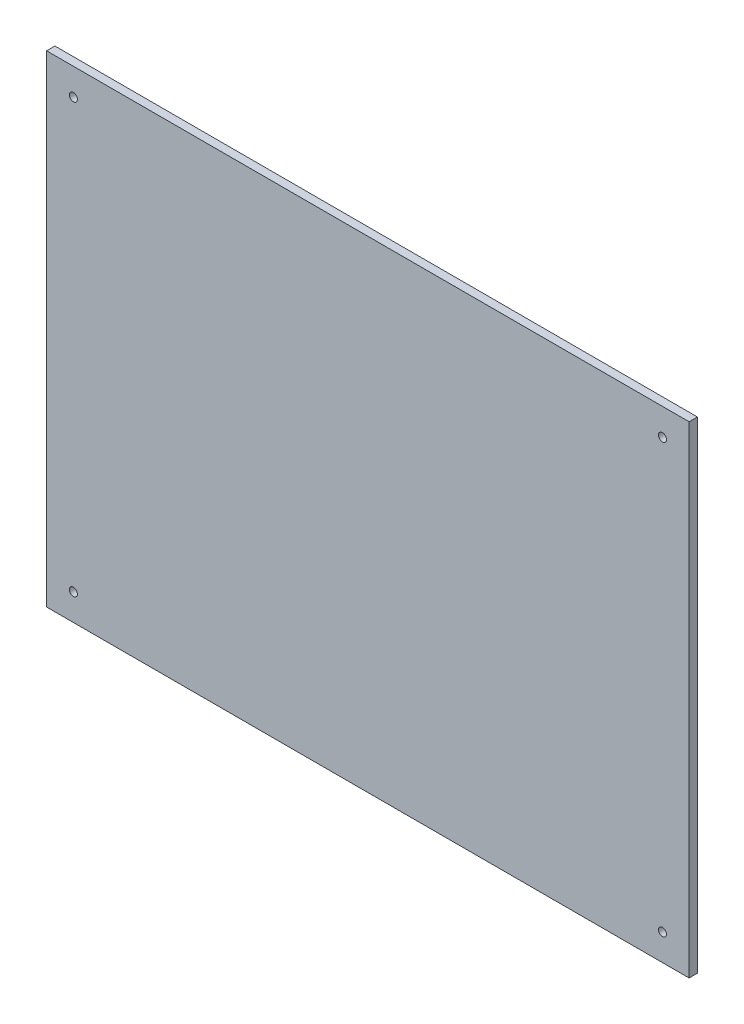
ISO-10303-21;
HEADER;
FILE_DESCRIPTION(('STEP AP214'),'2;1');
FILE_NAME('part.step','',(''),(''),'','','');
FILE_SCHEMA(('AUTOMOTIVE_DESIGN { 1 0 10303 214 1 1 1 1 }'));
ENDSEC;
DATA;
#1=APPLICATION_CONTEXT('core data for automotive mechanical design processes');
#2=APPLICATION_PROTOCOL_DEFINITION('international standard','automotive_design',2000,#1);
#3=PRODUCT_CONTEXT('',#1,'mechanical');
#4=PRODUCT('Part','Part','',(#3));
#5=PRODUCT_RELATED_PRODUCT_CATEGORY('part','',(#4));
#6=PRODUCT_DEFINITION_FORMATION('','',#4);
#7=PRODUCT_DEFINITION_CONTEXT('part definition',#1,'design');
#8=PRODUCT_DEFINITION('design','',#6,#7);
#9=PRODUCT_DEFINITION_SHAPE('','',#8);
#10=(LENGTH_UNIT() NAMED_UNIT(*) SI_UNIT(.MILLI.,.METRE.));
#11=(NAMED_UNIT(*) PLANE_ANGLE_UNIT() SI_UNIT($,.RADIAN.));
#12=(NAMED_UNIT(*) SI_UNIT($,.STERADIAN.) SOLID_ANGLE_UNIT());
#13=UNCERTAINTY_MEASURE_WITH_UNIT(LENGTH_MEASURE(1.E-05),#10,'distance_accuracy_value','');
#14=(GEOMETRIC_REPRESENTATION_CONTEXT(3) GLOBAL_UNCERTAINTY_ASSIGNED_CONTEXT((#13)) GLOBAL_UNIT_ASSIGNED_CONTEXT((#10,
#11,#12)) REPRESENTATION_CONTEXT('',''));
#15=CARTESIAN_POINT('',(0.,0.,0.));
#16=DIRECTION('',(0.,0.,1.));
#17=DIRECTION('',(1.,0.,0.));
#18=AXIS2_PLACEMENT_3D('',#15,#16,#17);
#19=CARTESIAN_POINT('',(0.,0.,1.5748));
#20=DIRECTION('',(0.,0.,1.));
#21=DIRECTION('',(1.,0.,0.));
#22=AXIS2_PLACEMENT_3D('',#19,#20,#21);
#23=PLANE('',#22);
#24=CARTESIAN_POINT('',(55.8900000000009,-40.66,1.5748));
#25=DIRECTION('',(0.,0.,1.));
#26=DIRECTION('',(1.,0.,0.));
#27=AXIS2_PLACEMENT_3D('',#24,#25,#26);
#28=CIRCLE('',#27,0.761999999999996);
#29=CARTESIAN_POINT('',(56.6520000000009,-40.66,1.5748));
#30=VERTEX_POINT('',#29);
#31=EDGE_CURVE('E121',#30,#30,#28,.T.);
#32=ORIENTED_EDGE('',*,*,#31,.F.);
#33=EDGE_LOOP('',(#32));
#34=FACE_BOUND('',#33,.T.);
#35=CARTESIAN_POINT('',(-55.87,40.62,1.5748));
#36=DIRECTION('',(0.,0.,1.));
#37=DIRECTION('',(1.,0.,0.));
#38=AXIS2_PLACEMENT_3D('',#35,#36,#37);
#39=CIRCLE('',#38,0.761999999999996);
#40=CARTESIAN_POINT('',(-55.108,40.62,1.5748));
#41=VERTEX_POINT('',#40);
#42=EDGE_CURVE('E100',#41,#41,#39,.T.);
#43=ORIENTED_EDGE('',*,*,#42,.F.);
#44=EDGE_LOOP('',(#43));
#45=FACE_BOUND('',#44,.T.);
#46=DIRECTION('',(0.,-1.,0.));
#47=VECTOR('',#46,1.);
#48=CARTESIAN_POINT('',(-60.95,-45.7,1.5748));
#49=LINE('',#48,#47);
#50=CARTESIAN_POINT('',(-60.95,45.7,1.5748));
#51=VERTEX_POINT('',#50);
#52=CARTESIAN_POINT('',(-60.95,-45.7,1.5748));
#53=VERTEX_POINT('',#52);
#54=EDGE_CURVE('E85',#51,#53,#49,.T.);
#55=ORIENTED_EDGE('',*,*,#54,.T.);
#56=DIRECTION('',(1.,0.,0.));
#57=VECTOR('',#56,1.);
#58=CARTESIAN_POINT('',(60.95,-45.7,1.5748));
#59=LINE('',#58,#57);
#60=CARTESIAN_POINT('',(60.95,-45.7,1.5748));
#61=VERTEX_POINT('',#60);
#62=EDGE_CURVE('E80',#53,#61,#59,.T.);
#63=ORIENTED_EDGE('',*,*,#62,.T.);
#64=DIRECTION('',(0.,1.,0.));
#65=VECTOR('',#64,1.);
#66=CARTESIAN_POINT('',(60.95,-45.7,1.5748));
#67=LINE('',#66,#65);
#68=CARTESIAN_POINT('',(60.95,45.7,1.5748));
#69=VERTEX_POINT('',#68);
#70=EDGE_CURVE('E83',#61,#69,#67,.T.);
#71=ORIENTED_EDGE('',*,*,#70,.T.);
#72=DIRECTION('',(-1.,0.,0.));
#73=VECTOR('',#72,1.);
#74=CARTESIAN_POINT('',(60.95,45.7,1.5748));
#75=LINE('',#74,#73);
#76=EDGE_CURVE('E50',#69,#51,#75,.T.);
#77=ORIENTED_EDGE('',*,*,#76,.T.);
#78=EDGE_LOOP('',(#55,#63,#71,#77));
#79=FACE_BOUND('',#78,.T.);
#80=CARTESIAN_POINT('',(55.89,40.62,1.5748));
#81=DIRECTION('',(0.,0.,1.));
#82=DIRECTION('',(1.,0.,0.));
#83=AXIS2_PLACEMENT_3D('',#80,#81,#82);
#84=CIRCLE('',#83,0.761999999999996);
#85=CARTESIAN_POINT('',(56.652,40.62,1.5748));
#86=VERTEX_POINT('',#85);
#87=EDGE_CURVE('E115',#86,#86,#84,.T.);
#88=ORIENTED_EDGE('',*,*,#87,.F.);
#89=EDGE_LOOP('',(#88));
#90=FACE_BOUND('',#89,.T.);
#91=CARTESIAN_POINT('',(-55.8699999999991,-40.66,1.5748));
#92=DIRECTION('',(0.,0.,1.));
#93=DIRECTION('',(1.,0.,0.));
#94=AXIS2_PLACEMENT_3D('',#91,#92,#93);
#95=CIRCLE('',#94,0.761999999999996);
#96=CARTESIAN_POINT('',(-55.1079999999991,-40.66,1.5748));
#97=VERTEX_POINT('',#96);
#98=EDGE_CURVE('E127',#97,#97,#95,.T.);
#99=ORIENTED_EDGE('',*,*,#98,.F.);
#100=EDGE_LOOP('',(#99));
#101=FACE_BOUND('',#100,.T.);
#102=ADVANCED_FACE('F33',(#34,#45,#79,#90,#101),#23,.T.);
#103=CARTESIAN_POINT('',(0.,0.,0.));
#104=DIRECTION('',(0.,0.,1.));
#105=DIRECTION('',(1.,0.,0.));
#106=AXIS2_PLACEMENT_3D('',#103,#104,#105);
#107=PLANE('',#106);
#108=CARTESIAN_POINT('',(55.8900000000009,-40.66,0.));
#109=DIRECTION('',(0.,0.,1.));
#110=DIRECTION('',(1.,0.,0.));
#111=AXIS2_PLACEMENT_3D('',#108,#109,#110);
#112=CIRCLE('',#111,0.761999999999996);
#113=CARTESIAN_POINT('',(56.6520000000009,-40.66,0.));
#114=VERTEX_POINT('',#113);
#115=EDGE_CURVE('E124',#114,#114,#112,.T.);
#116=ORIENTED_EDGE('',*,*,#115,.T.);
#117=EDGE_LOOP('',(#116));
#118=FACE_BOUND('',#117,.T.);
#119=CARTESIAN_POINT('',(-55.87,40.62,0.));
#120=DIRECTION('',(0.,0.,1.));
#121=DIRECTION('',(1.,0.,0.));
#122=AXIS2_PLACEMENT_3D('',#119,#120,#121);
#123=CIRCLE('',#122,0.761999999999996);
#124=CARTESIAN_POINT('',(-55.108,40.62,0.));
#125=VERTEX_POINT('',#124);
#126=EDGE_CURVE('E112',#125,#125,#123,.T.);
#127=ORIENTED_EDGE('',*,*,#126,.T.);
#128=EDGE_LOOP('',(#127));
#129=FACE_BOUND('',#128,.T.);
#130=DIRECTION('',(0.,-1.,0.));
#131=VECTOR('',#130,1.);
#132=CARTESIAN_POINT('',(-60.95,-45.7,0.));
#133=LINE('',#132,#131);
#134=CARTESIAN_POINT('',(-60.95,45.7,0.));
#135=VERTEX_POINT('',#134);
#136=CARTESIAN_POINT('',(-60.95,-45.7,0.));
#137=VERTEX_POINT('',#136);
#138=EDGE_CURVE('E97',#135,#137,#133,.T.);
#139=ORIENTED_EDGE('',*,*,#138,.F.);
#140=DIRECTION('',(-1.,0.,0.));
#141=VECTOR('',#140,1.);
#142=CARTESIAN_POINT('',(60.95,45.7,0.));
#143=LINE('',#142,#141);
#144=CARTESIAN_POINT('',(60.95,45.7,0.));
#145=VERTEX_POINT('',#144);
#146=EDGE_CURVE('E73',#145,#135,#143,.T.);
#147=ORIENTED_EDGE('',*,*,#146,.F.);
#148=DIRECTION('',(0.,1.,0.));
#149=VECTOR('',#148,1.);
#150=CARTESIAN_POINT('',(60.95,-45.7,0.));
#151=LINE('',#150,#149);
#152=CARTESIAN_POINT('',(60.95,-45.7,0.));
#153=VERTEX_POINT('',#152);
#154=EDGE_CURVE('E67',#153,#145,#151,.T.);
#155=ORIENTED_EDGE('',*,*,#154,.F.);
#156=DIRECTION('',(1.,0.,0.));
#157=VECTOR('',#156,1.);
#158=CARTESIAN_POINT('',(60.95,-45.7,0.));
#159=LINE('',#158,#157);
#160=EDGE_CURVE('E89',#137,#153,#159,.T.);
#161=ORIENTED_EDGE('',*,*,#160,.F.);
#162=EDGE_LOOP('',(#139,#147,#155,#161));
#163=FACE_BOUND('',#162,.T.);
#164=CARTESIAN_POINT('',(55.89,40.62,0.));
#165=DIRECTION('',(0.,0.,1.));
#166=DIRECTION('',(1.,0.,0.));
#167=AXIS2_PLACEMENT_3D('',#164,#165,#166);
#168=CIRCLE('',#167,0.761999999999996);
#169=CARTESIAN_POINT('',(56.652,40.62,0.));
#170=VERTEX_POINT('',#169);
#171=EDGE_CURVE('E118',#170,#170,#168,.T.);
#172=ORIENTED_EDGE('',*,*,#171,.T.);
#173=EDGE_LOOP('',(#172));
#174=FACE_BOUND('',#173,.T.);
#175=CARTESIAN_POINT('',(-55.8699999999991,-40.66,0.));
#176=DIRECTION('',(0.,0.,1.));
#177=DIRECTION('',(1.,0.,0.));
#178=AXIS2_PLACEMENT_3D('',#175,#176,#177);
#179=CIRCLE('',#178,0.761999999999996);
#180=CARTESIAN_POINT('',(-55.1079999999991,-40.66,0.));
#181=VERTEX_POINT('',#180);
#182=EDGE_CURVE('E130',#181,#181,#179,.T.);
#183=ORIENTED_EDGE('',*,*,#182,.T.);
#184=EDGE_LOOP('',(#183));
#185=FACE_BOUND('',#184,.T.);
#186=ADVANCED_FACE('F108',(#118,#129,#163,#174,#185),#107,.F.);
#187=CARTESIAN_POINT('',(-60.95,-45.7,1.5748));
#188=DIRECTION('',(1.,0.,0.));
#189=DIRECTION('',(0.,0.,-1.));
#190=AXIS2_PLACEMENT_3D('',#187,#188,#189);
#191=PLANE('',#190);
#192=ORIENTED_EDGE('',*,*,#138,.T.);
#193=DIRECTION('',(0.,0.,-1.));
#194=VECTOR('',#193,1.);
#195=CARTESIAN_POINT('',(-60.95,-45.7,1.5748));
#196=LINE('',#195,#194);
#197=EDGE_CURVE('E11',#53,#137,#196,.T.);
#198=ORIENTED_EDGE('',*,*,#197,.F.);
#199=ORIENTED_EDGE('',*,*,#54,.F.);
#200=DIRECTION('',(0.,0.,-1.));
#201=VECTOR('',#200,1.);
#202=CARTESIAN_POINT('',(-60.95,45.7,1.5748));
#203=LINE('',#202,#201);
#204=EDGE_CURVE('E93',#51,#135,#203,.T.);
#205=ORIENTED_EDGE('',*,*,#204,.T.);
#206=EDGE_LOOP('',(#192,#198,#199,#205));
#207=FACE_BOUND('',#206,.T.);
#208=ADVANCED_FACE('F35',(#207),#191,.F.);
#209=CARTESIAN_POINT('',(60.95,-45.7,1.5748));
#210=DIRECTION('',(0.,1.,0.));
#211=DIRECTION('',(-1.,0.,0.));
#212=AXIS2_PLACEMENT_3D('',#209,#210,#211);
#213=PLANE('',#212);
#214=ORIENTED_EDGE('',*,*,#160,.T.);
#215=DIRECTION('',(0.,0.,-1.));
#216=VECTOR('',#215,1.);
#217=CARTESIAN_POINT('',(60.95,-45.7,1.5748));
#218=LINE('',#217,#216);
#219=EDGE_CURVE('E42',#61,#153,#218,.T.);
#220=ORIENTED_EDGE('',*,*,#219,.F.);
#221=ORIENTED_EDGE('',*,*,#62,.F.);
#222=ORIENTED_EDGE('',*,*,#197,.T.);
#223=EDGE_LOOP('',(#214,#220,#221,#222));
#224=FACE_BOUND('',#223,.T.);
#225=ADVANCED_FACE('F88',(#224),#213,.F.);
#226=CARTESIAN_POINT('',(60.95,-45.7,1.5748));
#227=DIRECTION('',(-1.,0.,0.));
#228=DIRECTION('',(0.,0.,1.));
#229=AXIS2_PLACEMENT_3D('',#226,#227,#228);
#230=PLANE('',#229);
#231=ORIENTED_EDGE('',*,*,#154,.T.);
#232=DIRECTION('',(0.,0.,-1.));
#233=VECTOR('',#232,1.);
#234=CARTESIAN_POINT('',(60.95,45.7,1.5748));
#235=LINE('',#234,#233);
#236=EDGE_CURVE('E90',#69,#145,#235,.T.);
#237=ORIENTED_EDGE('',*,*,#236,.F.);
#238=ORIENTED_EDGE('',*,*,#70,.F.);
#239=ORIENTED_EDGE('',*,*,#219,.T.);
#240=EDGE_LOOP('',(#231,#237,#238,#239));
#241=FACE_BOUND('',#240,.T.);
#242=ADVANCED_FACE('F91',(#241),#230,.F.);
#243=CARTESIAN_POINT('',(60.95,45.7,1.5748));
#244=DIRECTION('',(0.,-1.,0.));
#245=DIRECTION('',(1.,0.,0.));
#246=AXIS2_PLACEMENT_3D('',#243,#244,#245);
#247=PLANE('',#246);
#248=ORIENTED_EDGE('',*,*,#146,.T.);
#249=ORIENTED_EDGE('',*,*,#204,.F.);
#250=ORIENTED_EDGE('',*,*,#76,.F.);
#251=ORIENTED_EDGE('',*,*,#236,.T.);
#252=EDGE_LOOP('',(#248,#249,#250,#251));
#253=FACE_BOUND('',#252,.T.);
#254=ADVANCED_FACE('F105',(#253),#247,.F.);
#255=CARTESIAN_POINT('',(-55.87,40.62,1.5748));
#256=DIRECTION('',(0.,0.,-1.));
#257=DIRECTION('',(-1.,0.,0.));
#258=AXIS2_PLACEMENT_3D('',#255,#256,#257);
#259=CYLINDRICAL_SURFACE('',#258,0.761999999999996);
#260=ORIENTED_EDGE('',*,*,#42,.T.);
#261=EDGE_LOOP('',(#260));
#262=FACE_BOUND('',#261,.T.);
#263=ORIENTED_EDGE('',*,*,#126,.F.);
#264=EDGE_LOOP('',(#263));
#265=FACE_BOUND('',#264,.T.);
#266=ADVANCED_FACE('F150',(#262,#265),#259,.F.);
#267=CARTESIAN_POINT('',(55.89,40.62,1.5748));
#268=DIRECTION('',(0.,0.,-1.));
#269=DIRECTION('',(-1.,0.,0.));
#270=AXIS2_PLACEMENT_3D('',#267,#268,#269);
#271=CYLINDRICAL_SURFACE('',#270,0.761999999999996);
#272=ORIENTED_EDGE('',*,*,#87,.T.);
#273=EDGE_LOOP('',(#272));
#274=FACE_BOUND('',#273,.T.);
#275=ORIENTED_EDGE('',*,*,#171,.F.);
#276=EDGE_LOOP('',(#275));
#277=FACE_BOUND('',#276,.T.);
#278=ADVANCED_FACE('F196',(#274,#277),#271,.F.);
#279=CARTESIAN_POINT('',(55.8900000000009,-40.66,1.5748));
#280=DIRECTION('',(0.,0.,-1.));
#281=DIRECTION('',(-1.,0.,0.));
#282=AXIS2_PLACEMENT_3D('',#279,#280,#281);
#283=CYLINDRICAL_SURFACE('',#282,0.761999999999996);
#284=ORIENTED_EDGE('',*,*,#31,.T.);
#285=EDGE_LOOP('',(#284));
#286=FACE_BOUND('',#285,.T.);
#287=ORIENTED_EDGE('',*,*,#115,.F.);
#288=EDGE_LOOP('',(#287));
#289=FACE_BOUND('',#288,.T.);
#290=ADVANCED_FACE('F204',(#286,#289),#283,.F.);
#291=CARTESIAN_POINT('',(-55.8699999999991,-40.66,1.5748));
#292=DIRECTION('',(0.,0.,-1.));
#293=DIRECTION('',(-1.,0.,0.));
#294=AXIS2_PLACEMENT_3D('',#291,#292,#293);
#295=CYLINDRICAL_SURFACE('',#294,0.761999999999996);
#296=ORIENTED_EDGE('',*,*,#98,.T.);
#297=EDGE_LOOP('',(#296));
#298=FACE_BOUND('',#297,.T.);
#299=ORIENTED_EDGE('',*,*,#182,.F.);
#300=EDGE_LOOP('',(#299));
#301=FACE_BOUND('',#300,.T.);
#302=ADVANCED_FACE('F136',(#298,#301),#295,.F.);
#303=CLOSED_SHELL('',(#102,#186,#208,#225,#242,#254,#266,#278,#290,#302));
#304=MANIFOLD_SOLID_BREP('B2',#303);
#305=ADVANCED_BREP_SHAPE_REPRESENTATION('',(#18,#304),#14);
#306=SHAPE_DEFINITION_REPRESENTATION(#9,#305);
ENDSEC;
END-ISO-10303-21;
